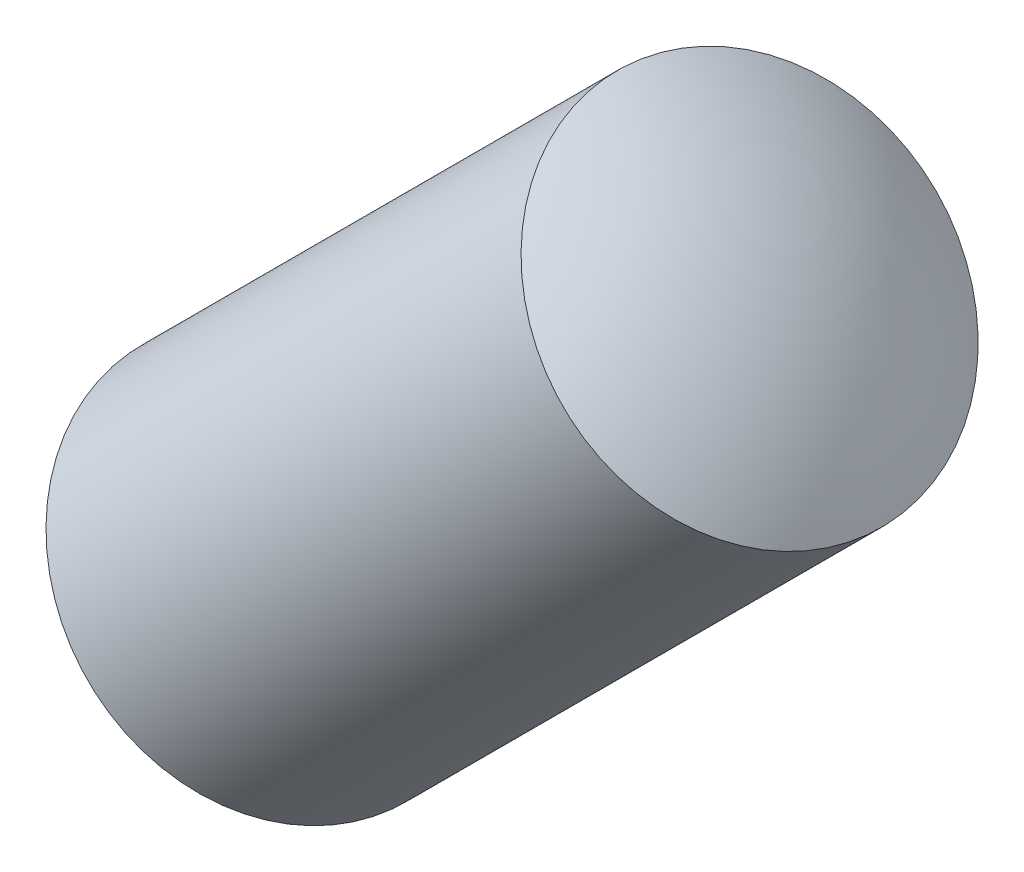
ISO-10303-21;
HEADER;
FILE_DESCRIPTION(('STEP AP214'),'2;1');
FILE_NAME('part.step','',(''),(''),'','','');
FILE_SCHEMA(('AUTOMOTIVE_DESIGN { 1 0 10303 214 1 1 1 1 }'));
ENDSEC;
DATA;
#1=APPLICATION_CONTEXT('core data for automotive mechanical design processes');
#2=APPLICATION_PROTOCOL_DEFINITION('international standard','automotive_design',2000,#1);
#3=PRODUCT_CONTEXT('',#1,'mechanical');
#4=PRODUCT('Part','Part','',(#3));
#5=PRODUCT_RELATED_PRODUCT_CATEGORY('part','',(#4));
#6=PRODUCT_DEFINITION_FORMATION('','',#4);
#7=PRODUCT_DEFINITION_CONTEXT('part definition',#1,'design');
#8=PRODUCT_DEFINITION('design','',#6,#7);
#9=PRODUCT_DEFINITION_SHAPE('','',#8);
#10=(LENGTH_UNIT() NAMED_UNIT(*) SI_UNIT(.MILLI.,.METRE.));
#11=(NAMED_UNIT(*) PLANE_ANGLE_UNIT() SI_UNIT($,.RADIAN.));
#12=(NAMED_UNIT(*) SI_UNIT($,.STERADIAN.) SOLID_ANGLE_UNIT());
#13=UNCERTAINTY_MEASURE_WITH_UNIT(LENGTH_MEASURE(1.E-05),#10,'distance_accuracy_value','');
#14=(GEOMETRIC_REPRESENTATION_CONTEXT(3) GLOBAL_UNCERTAINTY_ASSIGNED_CONTEXT((#13)) GLOBAL_UNIT_ASSIGNED_CONTEXT((#10,
#11,#12)) REPRESENTATION_CONTEXT('',''));
#15=CARTESIAN_POINT('',(0.,0.,0.));
#16=DIRECTION('',(0.,0.,1.));
#17=DIRECTION('',(1.,0.,0.));
#18=AXIS2_PLACEMENT_3D('',#15,#16,#17);
#19=CARTESIAN_POINT('',(-19.5175074847464,-19.5175074847464,0.9));
#20=DIRECTION('',(-0.707106781186548,0.707106781186548,0.));
#21=DIRECTION('',(-0.707106781186548,-0.707106781186548,0.));
#22=AXIS2_PLACEMENT_3D('',#19,#20,#21);
#23=SPHERICAL_SURFACE('',#22,3.);
#24=CARTESIAN_POINT('',(-19.5175074847464,-19.5175074847464,0.9));
#25=DIRECTION('',(0.707106781186548,0.707106781186547,0.));
#26=DIRECTION('',(0.,0.,-1.));
#27=AXIS2_PLACEMENT_3D('',#24,#25,#26);
#28=SPHERICAL_SURFACE('',#27,3.);
#29=CARTESIAN_POINT('',(-21.3546247918337,-21.3546247918337,0.9));
#30=DIRECTION('',(0.707106781186548,0.707106781186547,0.));
#31=DIRECTION('',(0.,0.,-1.));
#32=AXIS2_PLACEMENT_3D('',#29,#30,#31);
#33=CIRCLE('',#32,1.5);
#34=CARTESIAN_POINT('',(-21.3546247918337,-21.3546247918337,-0.6));
#35=VERTEX_POINT('',#34);
#36=EDGE_CURVE('E11',#35,#35,#33,.T.);
#37=ORIENTED_EDGE('',*,*,#36,.F.);
#38=EDGE_LOOP('',(#37));
#39=FACE_BOUND('',#38,.T.);
#40=ADVANCED_FACE('F17',(#39),#28,.T.);
#41=CARTESIAN_POINT('',(-19.3733654805138,-19.3733654805139,0.9));
#42=DIRECTION('',(-0.707106781186548,0.707106781186548,0.));
#43=DIRECTION('',(0.707106781186548,0.707106781186548,0.));
#44=AXIS2_PLACEMENT_3D('',#41,#42,#43);
#45=SPHERICAL_SURFACE('',#44,3.);
#46=CARTESIAN_POINT('',(-19.3733654805138,-19.3733654805139,0.9));
#47=DIRECTION('',(0.707106781186548,0.707106781186547,0.));
#48=DIRECTION('',(0.,0.,-1.));
#49=AXIS2_PLACEMENT_3D('',#46,#47,#48);
#50=SPHERICAL_SURFACE('',#49,3.);
#51=CARTESIAN_POINT('',(-17.5362481734264,-17.5362481734264,0.9));
#52=DIRECTION('',(0.707106781186548,0.707106781186547,0.));
#53=DIRECTION('',(0.,0.,-1.));
#54=AXIS2_PLACEMENT_3D('',#51,#52,#53);
#55=CIRCLE('',#54,1.5);
#56=CARTESIAN_POINT('',(-17.5362481734264,-17.5362481734264,-0.6));
#57=VERTEX_POINT('',#56);
#58=EDGE_CURVE('E21',#57,#57,#55,.T.);
#59=ORIENTED_EDGE('',*,*,#58,.T.);
#60=EDGE_LOOP('',(#59));
#61=FACE_BOUND('',#60,.T.);
#62=ADVANCED_FACE('F40',(#61),#50,.T.);
#63=CARTESIAN_POINT('',(-18.4908423280282,-18.4908423280282,0.9));
#64=DIRECTION('',(0.707106781186548,0.707106781186547,0.));
#65=DIRECTION('',(0.,0.,-1.));
#66=AXIS2_PLACEMENT_3D('',#63,#64,#65);
#67=CYLINDRICAL_SURFACE('',#66,1.5);
#68=ORIENTED_EDGE('',*,*,#36,.T.);
#69=EDGE_LOOP('',(#68));
#70=FACE_BOUND('',#69,.T.);
#71=ORIENTED_EDGE('',*,*,#58,.F.);
#72=EDGE_LOOP('',(#71));
#73=FACE_BOUND('',#72,.T.);
#74=ADVANCED_FACE('F19',(#70,#73),#67,.T.);
#75=CLOSED_SHELL('',(#40,#62,#74));
#76=MANIFOLD_SOLID_BREP('B1',#75);
#77=ADVANCED_BREP_SHAPE_REPRESENTATION('',(#18,#76),#14);
#78=SHAPE_DEFINITION_REPRESENTATION(#9,#77);
ENDSEC;
END-ISO-10303-21;
